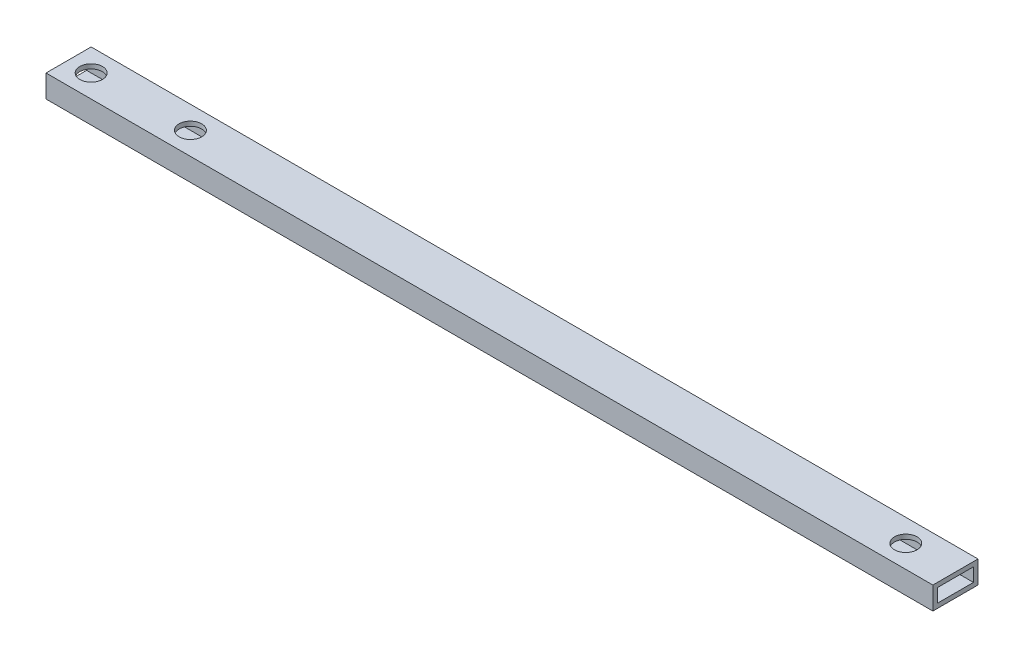
ISO-10303-21;
HEADER;
FILE_DESCRIPTION(('STEP AP214'),'2;1');
FILE_NAME('part.step','',(''),(''),'','','');
FILE_SCHEMA(('AUTOMOTIVE_DESIGN { 1 0 10303 214 1 1 1 1 }'));
ENDSEC;
DATA;
#1=APPLICATION_CONTEXT('core data for automotive mechanical design processes');
#2=APPLICATION_PROTOCOL_DEFINITION('international standard','automotive_design',2000,#1);
#3=PRODUCT_CONTEXT('',#1,'mechanical');
#4=PRODUCT('Part','Part','',(#3));
#5=PRODUCT_RELATED_PRODUCT_CATEGORY('part','',(#4));
#6=PRODUCT_DEFINITION_FORMATION('','',#4);
#7=PRODUCT_DEFINITION_CONTEXT('part definition',#1,'design');
#8=PRODUCT_DEFINITION('design','',#6,#7);
#9=PRODUCT_DEFINITION_SHAPE('','',#8);
#10=(LENGTH_UNIT() NAMED_UNIT(*) SI_UNIT(.MILLI.,.METRE.));
#11=(NAMED_UNIT(*) PLANE_ANGLE_UNIT() SI_UNIT($,.RADIAN.));
#12=(NAMED_UNIT(*) SI_UNIT($,.STERADIAN.) SOLID_ANGLE_UNIT());
#13=UNCERTAINTY_MEASURE_WITH_UNIT(LENGTH_MEASURE(1.E-05),#10,'distance_accuracy_value','');
#14=(GEOMETRIC_REPRESENTATION_CONTEXT(3) GLOBAL_UNCERTAINTY_ASSIGNED_CONTEXT((#13)) GLOBAL_UNIT_ASSIGNED_CONTEXT((#10,
#11,#12)) REPRESENTATION_CONTEXT('',''));
#15=CARTESIAN_POINT('',(0.,0.,0.));
#16=DIRECTION('',(0.,0.,1.));
#17=DIRECTION('',(1.,0.,0.));
#18=AXIS2_PLACEMENT_3D('',#15,#16,#17);
#19=CARTESIAN_POINT('',(0.,0.,0.));
#20=DIRECTION('',(-1.,0.,0.));
#21=DIRECTION('',(0.,0.,1.));
#22=AXIS2_PLACEMENT_3D('',#19,#20,#21);
#23=PLANE('',#22);
#24=DIRECTION('',(0.,1.,0.));
#25=VECTOR('',#24,1.);
#26=CARTESIAN_POINT('',(0.,-2.5,-5.));
#27=LINE('',#26,#25);
#28=CARTESIAN_POINT('',(0.,-2.5,-5.));
#29=VERTEX_POINT('',#28);
#30=CARTESIAN_POINT('',(0.,2.5,-5.));
#31=VERTEX_POINT('',#30);
#32=EDGE_CURVE('E121',#29,#31,#27,.T.);
#33=ORIENTED_EDGE('',*,*,#32,.F.);
#34=DIRECTION('',(0.,0.,-1.));
#35=VECTOR('',#34,1.);
#36=CARTESIAN_POINT('',(0.,-2.5,5.));
#37=LINE('',#36,#35);
#38=CARTESIAN_POINT('',(0.,-2.5,5.));
#39=VERTEX_POINT('',#38);
#40=EDGE_CURVE('E193',#39,#29,#37,.T.);
#41=ORIENTED_EDGE('',*,*,#40,.F.);
#42=DIRECTION('',(0.,-1.,0.));
#43=VECTOR('',#42,1.);
#44=CARTESIAN_POINT('',(0.,-2.5,5.));
#45=LINE('',#44,#43);
#46=CARTESIAN_POINT('',(0.,2.5,5.));
#47=VERTEX_POINT('',#46);
#48=EDGE_CURVE('E189',#47,#39,#45,.T.);
#49=ORIENTED_EDGE('',*,*,#48,.F.);
#50=DIRECTION('',(0.,0.,1.));
#51=VECTOR('',#50,1.);
#52=CARTESIAN_POINT('',(0.,2.5,5.));
#53=LINE('',#52,#51);
#54=EDGE_CURVE('E186',#31,#47,#53,.T.);
#55=ORIENTED_EDGE('',*,*,#54,.F.);
#56=EDGE_LOOP('',(#33,#41,#49,#55));
#57=FACE_BOUND('',#56,.T.);
#58=DIRECTION('',(0.,0.,-1.));
#59=VECTOR('',#58,1.);
#60=CARTESIAN_POINT('',(0.,-1.5,4.));
#61=LINE('',#60,#59);
#62=CARTESIAN_POINT('',(0.,-1.5,4.));
#63=VERTEX_POINT('',#62);
#64=CARTESIAN_POINT('',(0.,-1.5,-4.));
#65=VERTEX_POINT('',#64);
#66=EDGE_CURVE('E168',#63,#65,#61,.T.);
#67=ORIENTED_EDGE('',*,*,#66,.T.);
#68=DIRECTION('',(0.,1.,0.));
#69=VECTOR('',#68,1.);
#70=CARTESIAN_POINT('',(0.,-1.5,-4.));
#71=LINE('',#70,#69);
#72=CARTESIAN_POINT('',(0.,1.5,-4.));
#73=VERTEX_POINT('',#72);
#74=EDGE_CURVE('E148',#65,#73,#71,.T.);
#75=ORIENTED_EDGE('',*,*,#74,.T.);
#76=DIRECTION('',(0.,0.,1.));
#77=VECTOR('',#76,1.);
#78=CARTESIAN_POINT('',(0.,1.5,4.));
#79=LINE('',#78,#77);
#80=CARTESIAN_POINT('',(0.,1.5,4.));
#81=VERTEX_POINT('',#80);
#82=EDGE_CURVE('E160',#73,#81,#79,.T.);
#83=ORIENTED_EDGE('',*,*,#82,.T.);
#84=DIRECTION('',(0.,-1.,0.));
#85=VECTOR('',#84,1.);
#86=CARTESIAN_POINT('',(0.,-1.5,4.));
#87=LINE('',#86,#85);
#88=EDGE_CURVE('E164',#81,#63,#87,.T.);
#89=ORIENTED_EDGE('',*,*,#88,.T.);
#90=EDGE_LOOP('',(#67,#75,#83,#89));
#91=FACE_BOUND('',#90,.T.);
#92=ADVANCED_FACE('F38',(#57,#91),#23,.T.);
#93=CARTESIAN_POINT('',(393.,-2.5,-5.));
#94=DIRECTION('',(0.,0.,1.));
#95=DIRECTION('',(1.,0.,0.));
#96=AXIS2_PLACEMENT_3D('',#93,#94,#95);
#97=PLANE('',#96);
#98=DIRECTION('',(-1.,0.,0.));
#99=VECTOR('',#98,1.);
#100=CARTESIAN_POINT('',(393.,2.5,-5.));
#101=LINE('',#100,#99);
#102=CARTESIAN_POINT('',(196.5,2.5,-5.));
#103=VERTEX_POINT('',#102);
#104=EDGE_CURVE('E47',#103,#31,#101,.T.);
#105=ORIENTED_EDGE('',*,*,#104,.F.);
#106=DIRECTION('',(0.,-1.,0.));
#107=VECTOR('',#106,1.);
#108=CARTESIAN_POINT('',(196.5,2.5,-5.));
#109=LINE('',#108,#107);
#110=CARTESIAN_POINT('',(196.5,-2.5,-5.));
#111=VERTEX_POINT('',#110);
#112=EDGE_CURVE('E101',#103,#111,#109,.T.);
#113=ORIENTED_EDGE('',*,*,#112,.T.);
#114=DIRECTION('',(-1.,0.,0.));
#115=VECTOR('',#114,1.);
#116=CARTESIAN_POINT('',(393.,-2.5,-5.));
#117=LINE('',#116,#115);
#118=EDGE_CURVE('E197',#111,#29,#117,.T.);
#119=ORIENTED_EDGE('',*,*,#118,.T.);
#120=ORIENTED_EDGE('',*,*,#32,.T.);
#121=EDGE_LOOP('',(#105,#113,#119,#120));
#122=FACE_BOUND('',#121,.T.);
#123=ADVANCED_FACE('F40',(#122),#97,.F.);
#124=CARTESIAN_POINT('',(393.,2.5,5.));
#125=DIRECTION('',(0.,-1.,0.));
#126=DIRECTION('',(0.,0.,-1.));
#127=AXIS2_PLACEMENT_3D('',#124,#125,#126);
#128=PLANE('',#127);
#129=CARTESIAN_POINT('',(5.00000000000001,2.5,0.));
#130=DIRECTION('',(0.,1.,0.));
#131=DIRECTION('',(0.,0.,1.));
#132=AXIS2_PLACEMENT_3D('',#129,#130,#131);
#133=CIRCLE('',#132,2.5);
#134=CARTESIAN_POINT('',(5.00000000000001,2.5,2.5));
#135=VERTEX_POINT('',#134);
#136=EDGE_CURVE('E246',#135,#135,#133,.T.);
#137=ORIENTED_EDGE('',*,*,#136,.F.);
#138=EDGE_LOOP('',(#137));
#139=FACE_BOUND('',#138,.T.);
#140=CARTESIAN_POINT('',(185.5,2.5,0.));
#141=DIRECTION('',(0.,1.,0.));
#142=DIRECTION('',(0.,0.,1.));
#143=AXIS2_PLACEMENT_3D('',#140,#141,#142);
#144=CIRCLE('',#143,2.5);
#145=CARTESIAN_POINT('',(185.5,2.5,2.5));
#146=VERTEX_POINT('',#145);
#147=EDGE_CURVE('E242',#146,#146,#144,.T.);
#148=ORIENTED_EDGE('',*,*,#147,.F.);
#149=EDGE_LOOP('',(#148));
#150=FACE_BOUND('',#149,.T.);
#151=CARTESIAN_POINT('',(27.,2.5,0.));
#152=DIRECTION('',(0.,1.,0.));
#153=DIRECTION('',(0.,0.,1.));
#154=AXIS2_PLACEMENT_3D('',#151,#152,#153);
#155=CIRCLE('',#154,2.5);
#156=CARTESIAN_POINT('',(27.,2.5,2.5));
#157=VERTEX_POINT('',#156);
#158=EDGE_CURVE('E255',#157,#157,#155,.T.);
#159=ORIENTED_EDGE('',*,*,#158,.F.);
#160=EDGE_LOOP('',(#159));
#161=FACE_BOUND('',#160,.T.);
#162=DIRECTION('',(-1.,0.,0.));
#163=VECTOR('',#162,1.);
#164=CARTESIAN_POINT('',(393.,2.5,5.));
#165=LINE('',#164,#163);
#166=CARTESIAN_POINT('',(196.5,2.5,5.));
#167=VERTEX_POINT('',#166);
#168=EDGE_CURVE('E116',#167,#47,#165,.T.);
#169=ORIENTED_EDGE('',*,*,#168,.F.);
#170=DIRECTION('',(0.,0.,1.));
#171=VECTOR('',#170,1.);
#172=CARTESIAN_POINT('',(196.5,2.5,-5.));
#173=LINE('',#172,#171);
#174=EDGE_CURVE('E104',#103,#167,#173,.T.);
#175=ORIENTED_EDGE('',*,*,#174,.F.);
#176=ORIENTED_EDGE('',*,*,#104,.T.);
#177=ORIENTED_EDGE('',*,*,#54,.T.);
#178=EDGE_LOOP('',(#169,#175,#176,#177));
#179=FACE_BOUND('',#178,.T.);
#180=ADVANCED_FACE('F113',(#139,#150,#161,#179),#128,.F.);
#181=CARTESIAN_POINT('',(393.,-2.5,5.));
#182=DIRECTION('',(0.,0.,-1.));
#183=DIRECTION('',(-1.,0.,0.));
#184=AXIS2_PLACEMENT_3D('',#181,#182,#183);
#185=PLANE('',#184);
#186=DIRECTION('',(-1.,0.,0.));
#187=VECTOR('',#186,1.);
#188=CARTESIAN_POINT('',(393.,-2.5,5.));
#189=LINE('',#188,#187);
#190=CARTESIAN_POINT('',(196.5,-2.5,5.));
#191=VERTEX_POINT('',#190);
#192=EDGE_CURVE('E125',#191,#39,#189,.T.);
#193=ORIENTED_EDGE('',*,*,#192,.F.);
#194=DIRECTION('',(0.,-1.,0.));
#195=VECTOR('',#194,1.);
#196=CARTESIAN_POINT('',(196.5,2.5,5.));
#197=LINE('',#196,#195);
#198=EDGE_CURVE('E54',#167,#191,#197,.T.);
#199=ORIENTED_EDGE('',*,*,#198,.F.);
#200=ORIENTED_EDGE('',*,*,#168,.T.);
#201=ORIENTED_EDGE('',*,*,#48,.T.);
#202=EDGE_LOOP('',(#193,#199,#200,#201));
#203=FACE_BOUND('',#202,.T.);
#204=ADVANCED_FACE('F206',(#203),#185,.F.);
#205=CARTESIAN_POINT('',(393.,-2.5,5.));
#206=DIRECTION('',(0.,1.,0.));
#207=DIRECTION('',(0.,0.,1.));
#208=AXIS2_PLACEMENT_3D('',#205,#206,#207);
#209=PLANE('',#208);
#210=CARTESIAN_POINT('',(5.00000000000001,-2.5,0.));
#211=DIRECTION('',(0.,1.,0.));
#212=DIRECTION('',(0.,0.,1.));
#213=AXIS2_PLACEMENT_3D('',#210,#211,#212);
#214=CIRCLE('',#213,2.5);
#215=CARTESIAN_POINT('',(5.00000000000001,-2.5,2.5));
#216=VERTEX_POINT('',#215);
#217=EDGE_CURVE('E134',#216,#216,#214,.T.);
#218=ORIENTED_EDGE('',*,*,#217,.T.);
#219=EDGE_LOOP('',(#218));
#220=FACE_BOUND('',#219,.T.);
#221=CARTESIAN_POINT('',(185.5,-2.5,0.));
#222=DIRECTION('',(0.,1.,0.));
#223=DIRECTION('',(0.,0.,1.));
#224=AXIS2_PLACEMENT_3D('',#221,#222,#223);
#225=CIRCLE('',#224,2.5);
#226=CARTESIAN_POINT('',(185.5,-2.5,2.5));
#227=VERTEX_POINT('',#226);
#228=EDGE_CURVE('E251',#227,#227,#225,.T.);
#229=ORIENTED_EDGE('',*,*,#228,.T.);
#230=EDGE_LOOP('',(#229));
#231=FACE_BOUND('',#230,.T.);
#232=CARTESIAN_POINT('',(27.,-2.5,0.));
#233=DIRECTION('',(0.,1.,0.));
#234=DIRECTION('',(0.,0.,1.));
#235=AXIS2_PLACEMENT_3D('',#232,#233,#234);
#236=CIRCLE('',#235,2.5);
#237=CARTESIAN_POINT('',(27.,-2.5,2.5));
#238=VERTEX_POINT('',#237);
#239=EDGE_CURVE('E250',#238,#238,#236,.T.);
#240=ORIENTED_EDGE('',*,*,#239,.T.);
#241=EDGE_LOOP('',(#240));
#242=FACE_BOUND('',#241,.T.);
#243=ORIENTED_EDGE('',*,*,#118,.F.);
#244=DIRECTION('',(0.,0.,1.));
#245=VECTOR('',#244,1.);
#246=CARTESIAN_POINT('',(196.5,-2.5,-5.));
#247=LINE('',#246,#245);
#248=EDGE_CURVE('E105',#111,#191,#247,.T.);
#249=ORIENTED_EDGE('',*,*,#248,.T.);
#250=ORIENTED_EDGE('',*,*,#192,.T.);
#251=ORIENTED_EDGE('',*,*,#40,.T.);
#252=EDGE_LOOP('',(#243,#249,#250,#251));
#253=FACE_BOUND('',#252,.T.);
#254=ADVANCED_FACE('F202',(#220,#231,#242,#253),#209,.F.);
#255=CARTESIAN_POINT('',(393.,-1.5,-4.));
#256=DIRECTION('',(0.,0.,1.));
#257=DIRECTION('',(1.,0.,0.));
#258=AXIS2_PLACEMENT_3D('',#255,#256,#257);
#259=PLANE('',#258);
#260=DIRECTION('',(0.,-1.,0.));
#261=VECTOR('',#260,1.);
#262=CARTESIAN_POINT('',(196.5,-1.5,-4.));
#263=LINE('',#262,#261);
#264=CARTESIAN_POINT('',(196.5,1.5,-4.));
#265=VERTEX_POINT('',#264);
#266=CARTESIAN_POINT('',(196.5,-1.5,-4.));
#267=VERTEX_POINT('',#266);
#268=EDGE_CURVE('E61',#265,#267,#263,.T.);
#269=ORIENTED_EDGE('',*,*,#268,.F.);
#270=DIRECTION('',(-1.,0.,0.));
#271=VECTOR('',#270,1.);
#272=CARTESIAN_POINT('',(393.,1.5,-4.));
#273=LINE('',#272,#271);
#274=EDGE_CURVE('E181',#265,#73,#273,.T.);
#275=ORIENTED_EDGE('',*,*,#274,.T.);
#276=ORIENTED_EDGE('',*,*,#74,.F.);
#277=DIRECTION('',(-1.,0.,0.));
#278=VECTOR('',#277,1.);
#279=CARTESIAN_POINT('',(393.,-1.5,-4.));
#280=LINE('',#279,#278);
#281=EDGE_CURVE('E172',#267,#65,#280,.T.);
#282=ORIENTED_EDGE('',*,*,#281,.F.);
#283=EDGE_LOOP('',(#269,#275,#276,#282));
#284=FACE_BOUND('',#283,.T.);
#285=ADVANCED_FACE('F220',(#284),#259,.T.);
#286=CARTESIAN_POINT('',(393.,1.5,4.));
#287=DIRECTION('',(0.,-1.,0.));
#288=DIRECTION('',(0.,0.,-1.));
#289=AXIS2_PLACEMENT_3D('',#286,#287,#288);
#290=PLANE('',#289);
#291=DIRECTION('',(0.,0.,-1.));
#292=VECTOR('',#291,1.);
#293=CARTESIAN_POINT('',(196.5,1.5,4.));
#294=LINE('',#293,#292);
#295=CARTESIAN_POINT('',(196.5,1.5,4.));
#296=VERTEX_POINT('',#295);
#297=EDGE_CURVE('E228',#296,#265,#294,.T.);
#298=ORIENTED_EDGE('',*,*,#297,.F.);
#299=DIRECTION('',(-1.,0.,0.));
#300=VECTOR('',#299,1.);
#301=CARTESIAN_POINT('',(393.,1.5,4.));
#302=LINE('',#301,#300);
#303=EDGE_CURVE('E178',#296,#81,#302,.T.);
#304=ORIENTED_EDGE('',*,*,#303,.T.);
#305=ORIENTED_EDGE('',*,*,#82,.F.);
#306=ORIENTED_EDGE('',*,*,#274,.F.);
#307=EDGE_LOOP('',(#298,#304,#305,#306));
#308=FACE_BOUND('',#307,.T.);
#309=CARTESIAN_POINT('',(5.00000000000001,1.5,0.));
#310=DIRECTION('',(0.,-1.,0.));
#311=DIRECTION('',(0.,0.,-1.));
#312=AXIS2_PLACEMENT_3D('',#309,#310,#311);
#313=CIRCLE('',#312,2.5);
#314=CARTESIAN_POINT('',(5.00000000000001,1.5,-2.5));
#315=VERTEX_POINT('',#314);
#316=EDGE_CURVE('E142',#315,#315,#313,.T.);
#317=ORIENTED_EDGE('',*,*,#316,.F.);
#318=EDGE_LOOP('',(#317));
#319=FACE_BOUND('',#318,.T.);
#320=CARTESIAN_POINT('',(185.5,1.5,0.));
#321=DIRECTION('',(0.,-1.,0.));
#322=DIRECTION('',(0.,0.,-1.));
#323=AXIS2_PLACEMENT_3D('',#320,#321,#322);
#324=CIRCLE('',#323,2.5);
#325=CARTESIAN_POINT('',(185.5,1.5,-2.5));
#326=VERTEX_POINT('',#325);
#327=EDGE_CURVE('E138',#326,#326,#324,.T.);
#328=ORIENTED_EDGE('',*,*,#327,.F.);
#329=EDGE_LOOP('',(#328));
#330=FACE_BOUND('',#329,.T.);
#331=CARTESIAN_POINT('',(27.,1.5,0.));
#332=DIRECTION('',(0.,-1.,0.));
#333=DIRECTION('',(0.,0.,-1.));
#334=AXIS2_PLACEMENT_3D('',#331,#332,#333);
#335=CIRCLE('',#334,2.5);
#336=CARTESIAN_POINT('',(27.,1.5,-2.5));
#337=VERTEX_POINT('',#336);
#338=EDGE_CURVE('E133',#337,#337,#335,.T.);
#339=ORIENTED_EDGE('',*,*,#338,.F.);
#340=EDGE_LOOP('',(#339));
#341=FACE_BOUND('',#340,.T.);
#342=ADVANCED_FACE('F225',(#308,#319,#330,#341),#290,.T.);
#343=CARTESIAN_POINT('',(393.,-1.5,4.));
#344=DIRECTION('',(0.,0.,-1.));
#345=DIRECTION('',(-1.,0.,0.));
#346=AXIS2_PLACEMENT_3D('',#343,#344,#345);
#347=PLANE('',#346);
#348=DIRECTION('',(0.,1.,0.));
#349=VECTOR('',#348,1.);
#350=CARTESIAN_POINT('',(196.5,-1.5,4.));
#351=LINE('',#350,#349);
#352=CARTESIAN_POINT('',(196.5,-1.5,4.));
#353=VERTEX_POINT('',#352);
#354=EDGE_CURVE('E232',#353,#296,#351,.T.);
#355=ORIENTED_EDGE('',*,*,#354,.F.);
#356=DIRECTION('',(-1.,0.,0.));
#357=VECTOR('',#356,1.);
#358=CARTESIAN_POINT('',(393.,-1.5,4.));
#359=LINE('',#358,#357);
#360=EDGE_CURVE('E175',#353,#63,#359,.T.);
#361=ORIENTED_EDGE('',*,*,#360,.T.);
#362=ORIENTED_EDGE('',*,*,#88,.F.);
#363=ORIENTED_EDGE('',*,*,#303,.F.);
#364=EDGE_LOOP('',(#355,#361,#362,#363));
#365=FACE_BOUND('',#364,.T.);
#366=ADVANCED_FACE('F231',(#365),#347,.T.);
#367=CARTESIAN_POINT('',(393.,-1.5,4.));
#368=DIRECTION('',(0.,1.,0.));
#369=DIRECTION('',(0.,0.,1.));
#370=AXIS2_PLACEMENT_3D('',#367,#368,#369);
#371=PLANE('',#370);
#372=DIRECTION('',(0.,0.,1.));
#373=VECTOR('',#372,1.);
#374=CARTESIAN_POINT('',(196.5,-1.5,4.));
#375=LINE('',#374,#373);
#376=EDGE_CURVE('E11',#267,#353,#375,.T.);
#377=ORIENTED_EDGE('',*,*,#376,.F.);
#378=ORIENTED_EDGE('',*,*,#281,.T.);
#379=ORIENTED_EDGE('',*,*,#66,.F.);
#380=ORIENTED_EDGE('',*,*,#360,.F.);
#381=EDGE_LOOP('',(#377,#378,#379,#380));
#382=FACE_BOUND('',#381,.T.);
#383=CARTESIAN_POINT('',(5.00000000000001,-1.5,0.));
#384=DIRECTION('',(0.,1.,0.));
#385=DIRECTION('',(0.,0.,1.));
#386=AXIS2_PLACEMENT_3D('',#383,#384,#385);
#387=CIRCLE('',#386,2.5);
#388=CARTESIAN_POINT('',(5.00000000000001,-1.5,2.5));
#389=VERTEX_POINT('',#388);
#390=EDGE_CURVE('E139',#389,#389,#387,.T.);
#391=ORIENTED_EDGE('',*,*,#390,.F.);
#392=EDGE_LOOP('',(#391));
#393=FACE_BOUND('',#392,.T.);
#394=CARTESIAN_POINT('',(185.5,-1.5,0.));
#395=DIRECTION('',(0.,1.,0.));
#396=DIRECTION('',(0.,0.,1.));
#397=AXIS2_PLACEMENT_3D('',#394,#395,#396);
#398=CIRCLE('',#397,2.5);
#399=CARTESIAN_POINT('',(185.5,-1.5,2.5));
#400=VERTEX_POINT('',#399);
#401=EDGE_CURVE('E135',#400,#400,#398,.T.);
#402=ORIENTED_EDGE('',*,*,#401,.F.);
#403=EDGE_LOOP('',(#402));
#404=FACE_BOUND('',#403,.T.);
#405=CARTESIAN_POINT('',(27.,-1.5,0.));
#406=DIRECTION('',(0.,1.,0.));
#407=DIRECTION('',(0.,0.,1.));
#408=AXIS2_PLACEMENT_3D('',#405,#406,#407);
#409=CIRCLE('',#408,2.5);
#410=CARTESIAN_POINT('',(27.,-1.5,2.5));
#411=VERTEX_POINT('',#410);
#412=EDGE_CURVE('E129',#411,#411,#409,.T.);
#413=ORIENTED_EDGE('',*,*,#412,.F.);
#414=EDGE_LOOP('',(#413));
#415=FACE_BOUND('',#414,.T.);
#416=ADVANCED_FACE('F216',(#382,#393,#404,#415),#371,.T.);
#417=CARTESIAN_POINT('',(27.,-2.5,0.));
#418=DIRECTION('',(0.,1.,0.));
#419=DIRECTION('',(0.,0.,1.));
#420=AXIS2_PLACEMENT_3D('',#417,#418,#419);
#421=CYLINDRICAL_SURFACE('',#420,2.5);
#422=ORIENTED_EDGE('',*,*,#412,.T.);
#423=EDGE_LOOP('',(#422));
#424=FACE_BOUND('',#423,.T.);
#425=ORIENTED_EDGE('',*,*,#239,.F.);
#426=EDGE_LOOP('',(#425));
#427=FACE_BOUND('',#426,.T.);
#428=ADVANCED_FACE('F288',(#424,#427),#421,.F.);
#429=CARTESIAN_POINT('',(185.5,-2.5,0.));
#430=DIRECTION('',(0.,1.,0.));
#431=DIRECTION('',(0.,0.,1.));
#432=AXIS2_PLACEMENT_3D('',#429,#430,#431);
#433=CYLINDRICAL_SURFACE('',#432,2.5);
#434=ORIENTED_EDGE('',*,*,#401,.T.);
#435=EDGE_LOOP('',(#434));
#436=FACE_BOUND('',#435,.T.);
#437=ORIENTED_EDGE('',*,*,#228,.F.);
#438=EDGE_LOOP('',(#437));
#439=FACE_BOUND('',#438,.T.);
#440=ADVANCED_FACE('F291',(#436,#439),#433,.F.);
#441=CARTESIAN_POINT('',(5.00000000000001,-2.5,0.));
#442=DIRECTION('',(0.,1.,0.));
#443=DIRECTION('',(0.,0.,1.));
#444=AXIS2_PLACEMENT_3D('',#441,#442,#443);
#445=CYLINDRICAL_SURFACE('',#444,2.5);
#446=ORIENTED_EDGE('',*,*,#390,.T.);
#447=EDGE_LOOP('',(#446));
#448=FACE_BOUND('',#447,.T.);
#449=ORIENTED_EDGE('',*,*,#217,.F.);
#450=EDGE_LOOP('',(#449));
#451=FACE_BOUND('',#450,.T.);
#452=ADVANCED_FACE('F295',(#448,#451),#445,.F.);
#453=ORIENTED_EDGE('',*,*,#338,.T.);
#454=EDGE_LOOP('',(#453));
#455=FACE_BOUND('',#454,.T.);
#456=ORIENTED_EDGE('',*,*,#158,.T.);
#457=EDGE_LOOP('',(#456));
#458=FACE_BOUND('',#457,.T.);
#459=ADVANCED_FACE('F265',(#455,#458),#421,.F.);
#460=ORIENTED_EDGE('',*,*,#327,.T.);
#461=EDGE_LOOP('',(#460));
#462=FACE_BOUND('',#461,.T.);
#463=ORIENTED_EDGE('',*,*,#147,.T.);
#464=EDGE_LOOP('',(#463));
#465=FACE_BOUND('',#464,.T.);
#466=ADVANCED_FACE('F297',(#462,#465),#433,.F.);
#467=ORIENTED_EDGE('',*,*,#316,.T.);
#468=EDGE_LOOP('',(#467));
#469=FACE_BOUND('',#468,.T.);
#470=ORIENTED_EDGE('',*,*,#136,.T.);
#471=EDGE_LOOP('',(#470));
#472=FACE_BOUND('',#471,.T.);
#473=ADVANCED_FACE('F300',(#469,#472),#445,.F.);
#474=CARTESIAN_POINT('',(196.5,2.5,-5.));
#475=DIRECTION('',(-1.,0.,0.));
#476=DIRECTION('',(0.,0.,1.));
#477=AXIS2_PLACEMENT_3D('',#474,#475,#476);
#478=PLANE('',#477);
#479=ORIENTED_EDGE('',*,*,#268,.T.);
#480=ORIENTED_EDGE('',*,*,#376,.T.);
#481=ORIENTED_EDGE('',*,*,#354,.T.);
#482=ORIENTED_EDGE('',*,*,#297,.T.);
#483=EDGE_LOOP('',(#479,#480,#481,#482));
#484=FACE_BOUND('',#483,.T.);
#485=ORIENTED_EDGE('',*,*,#198,.T.);
#486=ORIENTED_EDGE('',*,*,#248,.F.);
#487=ORIENTED_EDGE('',*,*,#112,.F.);
#488=ORIENTED_EDGE('',*,*,#174,.T.);
#489=EDGE_LOOP('',(#485,#486,#487,#488));
#490=FACE_BOUND('',#489,.T.);
#491=ADVANCED_FACE('F103',(#484,#490),#478,.F.);
#492=CLOSED_SHELL('',(#92,#123,#180,#204,#254,#285,#342,#366,#416,#428,#440,#452,#459,#466,#473,#491));
#493=MANIFOLD_SOLID_BREP('B2',#492);
#494=ADVANCED_BREP_SHAPE_REPRESENTATION('',(#18,#493),#14);
#495=SHAPE_DEFINITION_REPRESENTATION(#9,#494);
ENDSEC;
END-ISO-10303-21;
